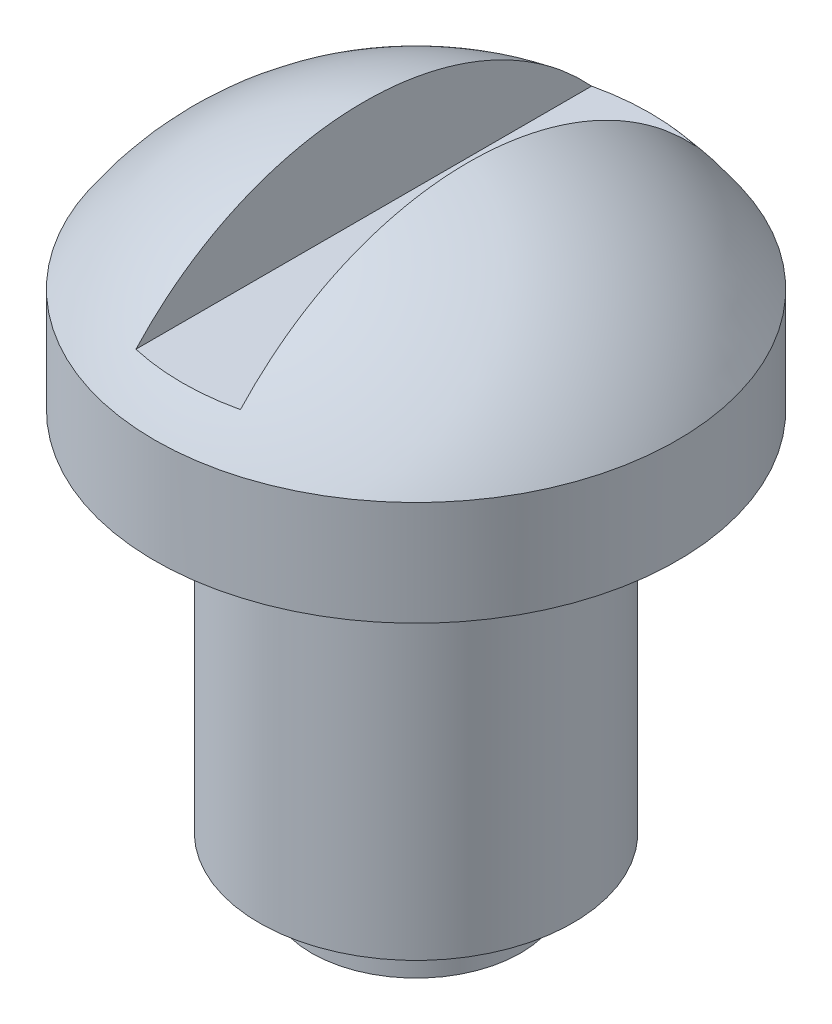
ISO-10303-21;
HEADER;
FILE_DESCRIPTION(('STEP AP214'),'2;1');
FILE_NAME('part.step','',(''),(''),'','','');
FILE_SCHEMA(('AUTOMOTIVE_DESIGN { 1 0 10303 214 1 1 1 1 }'));
ENDSEC;
DATA;
#1=APPLICATION_CONTEXT('core data for automotive mechanical design processes');
#2=APPLICATION_PROTOCOL_DEFINITION('international standard','automotive_design',2000,#1);
#3=PRODUCT_CONTEXT('',#1,'mechanical');
#4=PRODUCT('Part','Part','',(#3));
#5=PRODUCT_RELATED_PRODUCT_CATEGORY('part','',(#4));
#6=PRODUCT_DEFINITION_FORMATION('','',#4);
#7=PRODUCT_DEFINITION_CONTEXT('part definition',#1,'design');
#8=PRODUCT_DEFINITION('design','',#6,#7);
#9=PRODUCT_DEFINITION_SHAPE('','',#8);
#10=(LENGTH_UNIT() NAMED_UNIT(*) SI_UNIT(.MILLI.,.METRE.));
#11=(NAMED_UNIT(*) PLANE_ANGLE_UNIT() SI_UNIT($,.RADIAN.));
#12=(NAMED_UNIT(*) SI_UNIT($,.STERADIAN.) SOLID_ANGLE_UNIT());
#13=UNCERTAINTY_MEASURE_WITH_UNIT(LENGTH_MEASURE(1.E-05),#10,'distance_accuracy_value','');
#14=(GEOMETRIC_REPRESENTATION_CONTEXT(3) GLOBAL_UNCERTAINTY_ASSIGNED_CONTEXT((#13)) GLOBAL_UNIT_ASSIGNED_CONTEXT((#10,
#11,#12)) REPRESENTATION_CONTEXT('',''));
#15=CARTESIAN_POINT('',(0.,0.,0.));
#16=DIRECTION('',(0.,0.,1.));
#17=DIRECTION('',(1.,0.,0.));
#18=AXIS2_PLACEMENT_3D('',#15,#16,#17);
#19=CARTESIAN_POINT('',(0.,6.6833752096446,0.));
#20=DIRECTION('',(0.,1.,0.));
#21=DIRECTION('',(1.,0.,0.));
#22=AXIS2_PLACEMENT_3D('',#19,#20,#21);
#23=SPHERICAL_SURFACE('',#22,6.);
#24=CARTESIAN_POINT('',(0.,10.,0.));
#25=DIRECTION('',(0.,1.,0.));
#26=DIRECTION('',(-1.,0.,0.));
#27=AXIS2_PLACEMENT_3D('',#24,#25,#26);
#28=CIRCLE('',#27,5.);
#29=CARTESIAN_POINT('',(-5.,10.,0.));
#30=VERTEX_POINT('',#29);
#31=EDGE_CURVE('E96',#30,#30,#28,.T.);
#32=ORIENTED_EDGE('',*,*,#31,.T.);
#33=EDGE_LOOP('',(#32));
#34=FACE_BOUND('',#33,.T.);
#35=CARTESIAN_POINT('',(0.,10.6833752096446,0.));
#36=DIRECTION('',(0.,1.,0.));
#37=DIRECTION('',(0.,0.,1.));
#38=AXIS2_PLACEMENT_3D('',#35,#36,#37);
#39=CIRCLE('',#38,4.47213595499958);
#40=CARTESIAN_POINT('',(0.999999999999999,10.6833752096446,-4.35889894354067));
#41=VERTEX_POINT('',#40);
#42=CARTESIAN_POINT('',(-1.,10.6833752096446,-4.35889894354067));
#43=VERTEX_POINT('',#42);
#44=EDGE_CURVE('E13',#41,#43,#39,.T.);
#45=ORIENTED_EDGE('',*,*,#44,.F.);
#46=CARTESIAN_POINT('',(1.,6.6833752096446,0.));
#47=DIRECTION('',(1.,0.,0.));
#48=DIRECTION('',(0.,0.,-1.));
#49=AXIS2_PLACEMENT_3D('',#46,#47,#48);
#50=CIRCLE('',#49,5.91607978309962);
#51=CARTESIAN_POINT('',(1.,10.6833752096446,4.35889894354067));
#52=VERTEX_POINT('',#51);
#53=EDGE_CURVE('E48',#41,#52,#50,.T.);
#54=ORIENTED_EDGE('',*,*,#53,.T.);
#55=CARTESIAN_POINT('',(-1.,10.6833752096446,4.35889894354067));
#56=VERTEX_POINT('',#55);
#57=EDGE_CURVE('E54',#56,#52,#39,.T.);
#58=ORIENTED_EDGE('',*,*,#57,.F.);
#59=CARTESIAN_POINT('',(-1.,6.6833752096446,0.));
#60=DIRECTION('',(-1.,0.,0.));
#61=DIRECTION('',(0.,0.,1.));
#62=AXIS2_PLACEMENT_3D('',#59,#60,#61);
#63=CIRCLE('',#62,5.91607978309962);
#64=EDGE_CURVE('E76',#56,#43,#63,.T.);
#65=ORIENTED_EDGE('',*,*,#64,.T.);
#66=EDGE_LOOP('',(#45,#54,#58,#65));
#67=FACE_BOUND('',#66,.T.);
#68=ADVANCED_FACE('F44',(#34,#67),#23,.T.);
#69=CARTESIAN_POINT('',(0.,0.,0.));
#70=DIRECTION('',(0.,1.,0.));
#71=DIRECTION('',(-1.,0.,0.));
#72=AXIS2_PLACEMENT_3D('',#69,#70,#71);
#73=PLANE('',#72);
#74=CARTESIAN_POINT('',(0.,0.,0.));
#75=DIRECTION('',(0.,1.,0.));
#76=DIRECTION('',(-1.,0.,0.));
#77=AXIS2_PLACEMENT_3D('',#74,#75,#76);
#78=CIRCLE('',#77,2.);
#79=CARTESIAN_POINT('',(-2.,0.,0.));
#80=VERTEX_POINT('',#79);
#81=EDGE_CURVE('E77',#80,#80,#78,.T.);
#82=ORIENTED_EDGE('',*,*,#81,.F.);
#83=EDGE_LOOP('',(#82));
#84=FACE_BOUND('',#83,.T.);
#85=ADVANCED_FACE('F46',(#84),#73,.F.);
#86=CARTESIAN_POINT('',(0.,10.,0.));
#87=DIRECTION('',(0.,1.,0.));
#88=DIRECTION('',(-1.,0.,0.));
#89=AXIS2_PLACEMENT_3D('',#86,#87,#88);
#90=CYLINDRICAL_SURFACE('',#89,2.);
#91=CARTESIAN_POINT('',(0.,0.999999999999999,0.));
#92=DIRECTION('',(0.,1.,0.));
#93=DIRECTION('',(-1.,0.,0.));
#94=AXIS2_PLACEMENT_3D('',#91,#92,#93);
#95=CIRCLE('',#94,2.);
#96=CARTESIAN_POINT('',(-2.,0.999999999999999,0.));
#97=VERTEX_POINT('',#96);
#98=EDGE_CURVE('E84',#97,#97,#95,.T.);
#99=ORIENTED_EDGE('',*,*,#98,.F.);
#100=EDGE_LOOP('',(#99));
#101=FACE_BOUND('',#100,.T.);
#102=ORIENTED_EDGE('',*,*,#81,.T.);
#103=EDGE_LOOP('',(#102));
#104=FACE_BOUND('',#103,.T.);
#105=ADVANCED_FACE('F123',(#101,#104),#90,.T.);
#106=CARTESIAN_POINT('',(2.,1.,0.));
#107=DIRECTION('',(0.,1.,0.));
#108=DIRECTION('',(-1.,0.,0.));
#109=AXIS2_PLACEMENT_3D('',#106,#107,#108);
#110=PLANE('',#109);
#111=CARTESIAN_POINT('',(0.,0.999999999999999,0.));
#112=DIRECTION('',(0.,1.,0.));
#113=DIRECTION('',(-1.,0.,0.));
#114=AXIS2_PLACEMENT_3D('',#111,#112,#113);
#115=CIRCLE('',#114,3.);
#116=CARTESIAN_POINT('',(-3.,0.999999999999999,0.));
#117=VERTEX_POINT('',#116);
#118=EDGE_CURVE('E87',#117,#117,#115,.T.);
#119=ORIENTED_EDGE('',*,*,#118,.F.);
#120=EDGE_LOOP('',(#119));
#121=FACE_BOUND('',#120,.T.);
#122=ORIENTED_EDGE('',*,*,#98,.T.);
#123=EDGE_LOOP('',(#122));
#124=FACE_BOUND('',#123,.T.);
#125=ADVANCED_FACE('F117',(#121,#124),#110,.F.);
#126=CARTESIAN_POINT('',(0.,10.,0.));
#127=DIRECTION('',(0.,1.,0.));
#128=DIRECTION('',(-1.,0.,0.));
#129=AXIS2_PLACEMENT_3D('',#126,#127,#128);
#130=CYLINDRICAL_SURFACE('',#129,3.);
#131=CARTESIAN_POINT('',(0.,8.,0.));
#132=DIRECTION('',(0.,1.,0.));
#133=DIRECTION('',(-1.,0.,0.));
#134=AXIS2_PLACEMENT_3D('',#131,#132,#133);
#135=CIRCLE('',#134,3.);
#136=CARTESIAN_POINT('',(-3.,8.,0.));
#137=VERTEX_POINT('',#136);
#138=EDGE_CURVE('E90',#137,#137,#135,.T.);
#139=ORIENTED_EDGE('',*,*,#138,.F.);
#140=EDGE_LOOP('',(#139));
#141=FACE_BOUND('',#140,.T.);
#142=ORIENTED_EDGE('',*,*,#118,.T.);
#143=EDGE_LOOP('',(#142));
#144=FACE_BOUND('',#143,.T.);
#145=ADVANCED_FACE('F111',(#141,#144),#130,.T.);
#146=CARTESIAN_POINT('',(3.,8.,0.));
#147=DIRECTION('',(0.,1.,0.));
#148=DIRECTION('',(-1.,0.,0.));
#149=AXIS2_PLACEMENT_3D('',#146,#147,#148);
#150=PLANE('',#149);
#151=CARTESIAN_POINT('',(0.,8.,0.));
#152=DIRECTION('',(0.,1.,0.));
#153=DIRECTION('',(-1.,0.,0.));
#154=AXIS2_PLACEMENT_3D('',#151,#152,#153);
#155=CIRCLE('',#154,5.);
#156=CARTESIAN_POINT('',(-5.,8.,0.));
#157=VERTEX_POINT('',#156);
#158=EDGE_CURVE('E93',#157,#157,#155,.T.);
#159=ORIENTED_EDGE('',*,*,#158,.F.);
#160=EDGE_LOOP('',(#159));
#161=FACE_BOUND('',#160,.T.);
#162=ORIENTED_EDGE('',*,*,#138,.T.);
#163=EDGE_LOOP('',(#162));
#164=FACE_BOUND('',#163,.T.);
#165=ADVANCED_FACE('F105',(#161,#164),#150,.F.);
#166=CARTESIAN_POINT('',(0.,10.,0.));
#167=DIRECTION('',(0.,1.,0.));
#168=DIRECTION('',(-1.,0.,0.));
#169=AXIS2_PLACEMENT_3D('',#166,#167,#168);
#170=CYLINDRICAL_SURFACE('',#169,5.);
#171=ORIENTED_EDGE('',*,*,#31,.F.);
#172=EDGE_LOOP('',(#171));
#173=FACE_BOUND('',#172,.T.);
#174=ORIENTED_EDGE('',*,*,#158,.T.);
#175=EDGE_LOOP('',(#174));
#176=FACE_BOUND('',#175,.T.);
#177=ADVANCED_FACE('F102',(#173,#176),#170,.T.);
#178=CARTESIAN_POINT('',(0.999999999999999,10.6833752096446,-7.));
#179=DIRECTION('',(1.,0.,0.));
#180=DIRECTION('',(0.,0.,-1.));
#181=AXIS2_PLACEMENT_3D('',#178,#179,#180);
#182=PLANE('',#181);
#183=DIRECTION('',(0.,0.,-1.));
#184=VECTOR('',#183,1.);
#185=CARTESIAN_POINT('',(0.999999999999999,10.6833752096446,-7.));
#186=LINE('',#185,#184);
#187=EDGE_CURVE('E72',#52,#41,#186,.T.);
#188=ORIENTED_EDGE('',*,*,#187,.F.);
#189=ORIENTED_EDGE('',*,*,#53,.F.);
#190=EDGE_LOOP('',(#188,#189));
#191=FACE_BOUND('',#190,.T.);
#192=ADVANCED_FACE('F79',(#191),#182,.F.);
#193=CARTESIAN_POINT('',(-1.,10.6833752096446,-7.));
#194=DIRECTION('',(-1.,0.,0.));
#195=DIRECTION('',(0.,0.,1.));
#196=AXIS2_PLACEMENT_3D('',#193,#194,#195);
#197=PLANE('',#196);
#198=DIRECTION('',(0.,0.,1.));
#199=VECTOR('',#198,1.);
#200=CARTESIAN_POINT('',(-1.,10.6833752096446,-7.));
#201=LINE('',#200,#199);
#202=EDGE_CURVE('E60',#43,#56,#201,.T.);
#203=ORIENTED_EDGE('',*,*,#202,.F.);
#204=ORIENTED_EDGE('',*,*,#64,.F.);
#205=EDGE_LOOP('',(#203,#204));
#206=FACE_BOUND('',#205,.T.);
#207=ADVANCED_FACE('F141',(#206),#197,.F.);
#208=CARTESIAN_POINT('',(0.,10.6833752096446,0.));
#209=DIRECTION('',(0.,1.,0.));
#210=DIRECTION('',(0.,0.,1.));
#211=AXIS2_PLACEMENT_3D('',#208,#209,#210);
#212=PLANE('',#211);
#213=ORIENTED_EDGE('',*,*,#44,.T.);
#214=ORIENTED_EDGE('',*,*,#202,.T.);
#215=ORIENTED_EDGE('',*,*,#57,.T.);
#216=ORIENTED_EDGE('',*,*,#187,.T.);
#217=EDGE_LOOP('',(#213,#214,#215,#216));
#218=FACE_BOUND('',#217,.T.);
#219=ADVANCED_FACE('F71',(#218),#212,.T.);
#220=CLOSED_SHELL('',(#68,#85,#105,#125,#145,#165,#177,#192,#207,#219));
#221=MANIFOLD_SOLID_BREP('B2',#220);
#222=ADVANCED_BREP_SHAPE_REPRESENTATION('',(#18,#221),#14);
#223=SHAPE_DEFINITION_REPRESENTATION(#9,#222);
ENDSEC;
END-ISO-10303-21;
